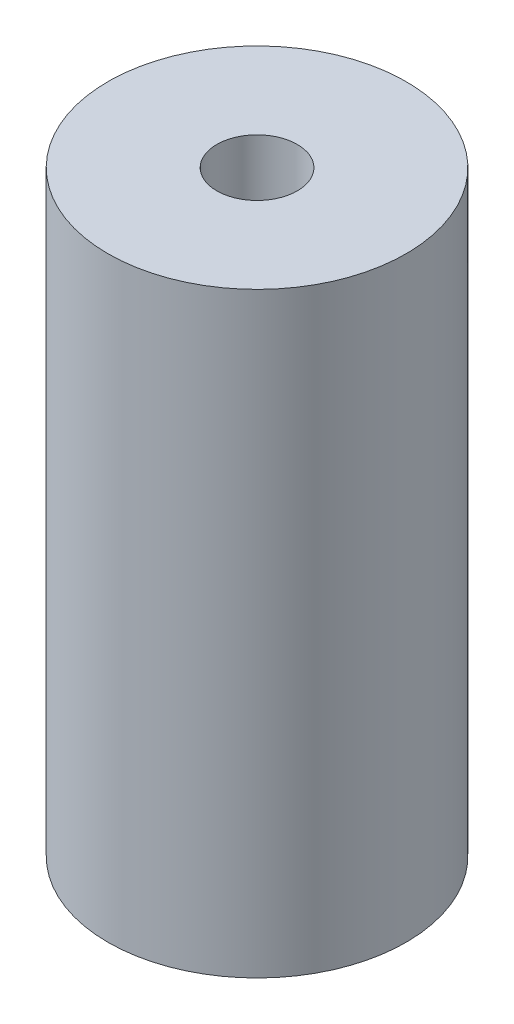
ISO-10303-21;
HEADER;
FILE_DESCRIPTION(('STEP AP214'),'2;1');
FILE_NAME('part.step','',(''),(''),'','','');
FILE_SCHEMA(('AUTOMOTIVE_DESIGN { 1 0 10303 214 1 1 1 1 }'));
ENDSEC;
DATA;
#1=APPLICATION_CONTEXT('core data for automotive mechanical design processes');
#2=APPLICATION_PROTOCOL_DEFINITION('international standard','automotive_design',2000,#1);
#3=PRODUCT_CONTEXT('',#1,'mechanical');
#4=PRODUCT('Part','Part','',(#3));
#5=PRODUCT_RELATED_PRODUCT_CATEGORY('part','',(#4));
#6=PRODUCT_DEFINITION_FORMATION('','',#4);
#7=PRODUCT_DEFINITION_CONTEXT('part definition',#1,'design');
#8=PRODUCT_DEFINITION('design','',#6,#7);
#9=PRODUCT_DEFINITION_SHAPE('','',#8);
#10=(LENGTH_UNIT() NAMED_UNIT(*) SI_UNIT(.MILLI.,.METRE.));
#11=(NAMED_UNIT(*) PLANE_ANGLE_UNIT() SI_UNIT($,.RADIAN.));
#12=(NAMED_UNIT(*) SI_UNIT($,.STERADIAN.) SOLID_ANGLE_UNIT());
#13=UNCERTAINTY_MEASURE_WITH_UNIT(LENGTH_MEASURE(1.E-05),#10,'distance_accuracy_value','');
#14=(GEOMETRIC_REPRESENTATION_CONTEXT(3) GLOBAL_UNCERTAINTY_ASSIGNED_CONTEXT((#13)) GLOBAL_UNIT_ASSIGNED_CONTEXT((#10,
#11,#12)) REPRESENTATION_CONTEXT('',''));
#15=CARTESIAN_POINT('',(0.,0.,0.));
#16=DIRECTION('',(0.,0.,1.));
#17=DIRECTION('',(1.,0.,0.));
#18=AXIS2_PLACEMENT_3D('',#15,#16,#17);
#19=CARTESIAN_POINT('',(0.,20.,0.));
#20=DIRECTION('',(0.,-1.,0.));
#21=DIRECTION('',(0.,0.,-1.));
#22=AXIS2_PLACEMENT_3D('',#19,#20,#21);
#23=CYLINDRICAL_SURFACE('',#22,5.);
#24=CARTESIAN_POINT('',(0.,20.,0.));
#25=DIRECTION('',(0.,1.,0.));
#26=DIRECTION('',(0.,0.,1.));
#27=AXIS2_PLACEMENT_3D('',#24,#25,#26);
#28=CIRCLE('',#27,5.);
#29=CARTESIAN_POINT('',(0.,20.,5.));
#30=VERTEX_POINT('',#29);
#31=EDGE_CURVE('E10',#30,#30,#28,.T.);
#32=ORIENTED_EDGE('',*,*,#31,.F.);
#33=EDGE_LOOP('',(#32));
#34=FACE_BOUND('',#33,.T.);
#35=CARTESIAN_POINT('',(0.,0.,0.));
#36=DIRECTION('',(0.,1.,0.));
#37=DIRECTION('',(0.,0.,1.));
#38=AXIS2_PLACEMENT_3D('',#35,#36,#37);
#39=CIRCLE('',#38,5.);
#40=CARTESIAN_POINT('',(0.,0.,5.));
#41=VERTEX_POINT('',#40);
#42=EDGE_CURVE('E34',#41,#41,#39,.T.);
#43=ORIENTED_EDGE('',*,*,#42,.T.);
#44=EDGE_LOOP('',(#43));
#45=FACE_BOUND('',#44,.T.);
#46=ADVANCED_FACE('F31',(#34,#45),#23,.T.);
#47=CARTESIAN_POINT('',(0.,20.,0.));
#48=DIRECTION('',(0.,1.,0.));
#49=DIRECTION('',(0.,0.,1.));
#50=AXIS2_PLACEMENT_3D('',#47,#48,#49);
#51=PLANE('',#50);
#52=CARTESIAN_POINT('',(0.,20.,0.));
#53=DIRECTION('',(0.,1.,0.));
#54=DIRECTION('',(0.,0.,1.));
#55=AXIS2_PLACEMENT_3D('',#52,#53,#54);
#56=CIRCLE('',#55,1.35);
#57=CARTESIAN_POINT('',(0.,20.,1.35));
#58=VERTEX_POINT('',#57);
#59=EDGE_CURVE('E43',#58,#58,#56,.T.);
#60=ORIENTED_EDGE('',*,*,#59,.F.);
#61=EDGE_LOOP('',(#60));
#62=FACE_BOUND('',#61,.T.);
#63=ORIENTED_EDGE('',*,*,#31,.T.);
#64=EDGE_LOOP('',(#63));
#65=FACE_BOUND('',#64,.T.);
#66=ADVANCED_FACE('F68',(#62,#65),#51,.T.);
#67=CARTESIAN_POINT('',(0.,0.,0.));
#68=DIRECTION('',(0.,1.,0.));
#69=DIRECTION('',(0.,0.,1.));
#70=AXIS2_PLACEMENT_3D('',#67,#68,#69);
#71=PLANE('',#70);
#72=CARTESIAN_POINT('',(0.,0.,0.));
#73=DIRECTION('',(0.,-1.,0.));
#74=DIRECTION('',(0.,0.,-1.));
#75=AXIS2_PLACEMENT_3D('',#72,#73,#74);
#76=CIRCLE('',#75,1.35);
#77=CARTESIAN_POINT('',(0.,0.,-1.35));
#78=VERTEX_POINT('',#77);
#79=EDGE_CURVE('E49',#78,#78,#76,.T.);
#80=ORIENTED_EDGE('',*,*,#79,.F.);
#81=EDGE_LOOP('',(#80));
#82=FACE_BOUND('',#81,.T.);
#83=ORIENTED_EDGE('',*,*,#42,.F.);
#84=EDGE_LOOP('',(#83));
#85=FACE_BOUND('',#84,.T.);
#86=ADVANCED_FACE('F64',(#82,#85),#71,.F.);
#87=CARTESIAN_POINT('',(0.,14.,0.));
#88=DIRECTION('',(0.,1.,0.));
#89=DIRECTION('',(0.,0.,1.));
#90=AXIS2_PLACEMENT_3D('',#87,#88,#89);
#91=CYLINDRICAL_SURFACE('',#90,1.35);
#92=CARTESIAN_POINT('',(0.,14.,0.));
#93=DIRECTION('',(0.,1.,0.));
#94=DIRECTION('',(0.,0.,1.));
#95=AXIS2_PLACEMENT_3D('',#92,#93,#94);
#96=CIRCLE('',#95,1.35);
#97=CARTESIAN_POINT('',(0.,14.,1.35));
#98=VERTEX_POINT('',#97);
#99=EDGE_CURVE('E41',#98,#98,#96,.T.);
#100=ORIENTED_EDGE('',*,*,#99,.F.);
#101=EDGE_LOOP('',(#100));
#102=FACE_BOUND('',#101,.T.);
#103=ORIENTED_EDGE('',*,*,#59,.T.);
#104=EDGE_LOOP('',(#103));
#105=FACE_BOUND('',#104,.T.);
#106=ADVANCED_FACE('F67',(#102,#105),#91,.F.);
#107=CARTESIAN_POINT('',(0.,14.,0.));
#108=DIRECTION('',(0.,1.,0.));
#109=DIRECTION('',(0.,0.,1.));
#110=AXIS2_PLACEMENT_3D('',#107,#108,#109);
#111=PLANE('',#110);
#112=ORIENTED_EDGE('',*,*,#99,.T.);
#113=EDGE_LOOP('',(#112));
#114=FACE_BOUND('',#113,.T.);
#115=ADVANCED_FACE('F60',(#114),#111,.T.);
#116=CARTESIAN_POINT('',(0.,10.,0.));
#117=DIRECTION('',(0.,-1.,0.));
#118=DIRECTION('',(0.,0.,-1.));
#119=AXIS2_PLACEMENT_3D('',#116,#117,#118);
#120=CYLINDRICAL_SURFACE('',#119,1.35);
#121=CARTESIAN_POINT('',(0.,10.,0.));
#122=DIRECTION('',(0.,-1.,0.));
#123=DIRECTION('',(0.,0.,-1.));
#124=AXIS2_PLACEMENT_3D('',#121,#122,#123);
#125=CIRCLE('',#124,1.35);
#126=CARTESIAN_POINT('',(0.,10.,-1.35));
#127=VERTEX_POINT('',#126);
#128=EDGE_CURVE('E46',#127,#127,#125,.T.);
#129=ORIENTED_EDGE('',*,*,#128,.F.);
#130=EDGE_LOOP('',(#129));
#131=FACE_BOUND('',#130,.T.);
#132=ORIENTED_EDGE('',*,*,#79,.T.);
#133=EDGE_LOOP('',(#132));
#134=FACE_BOUND('',#133,.T.);
#135=ADVANCED_FACE('F57',(#131,#134),#120,.F.);
#136=CARTESIAN_POINT('',(0.,10.,0.));
#137=DIRECTION('',(0.,-1.,0.));
#138=DIRECTION('',(0.,0.,-1.));
#139=AXIS2_PLACEMENT_3D('',#136,#137,#138);
#140=PLANE('',#139);
#141=ORIENTED_EDGE('',*,*,#128,.T.);
#142=EDGE_LOOP('',(#141));
#143=FACE_BOUND('',#142,.T.);
#144=ADVANCED_FACE('F55',(#143),#140,.T.);
#145=CLOSED_SHELL('',(#46,#66,#86,#106,#115,#135,#144));
#146=MANIFOLD_SOLID_BREP('B2',#145);
#147=ADVANCED_BREP_SHAPE_REPRESENTATION('',(#18,#146),#14);
#148=SHAPE_DEFINITION_REPRESENTATION(#9,#147);
ENDSEC;
END-ISO-10303-21;
